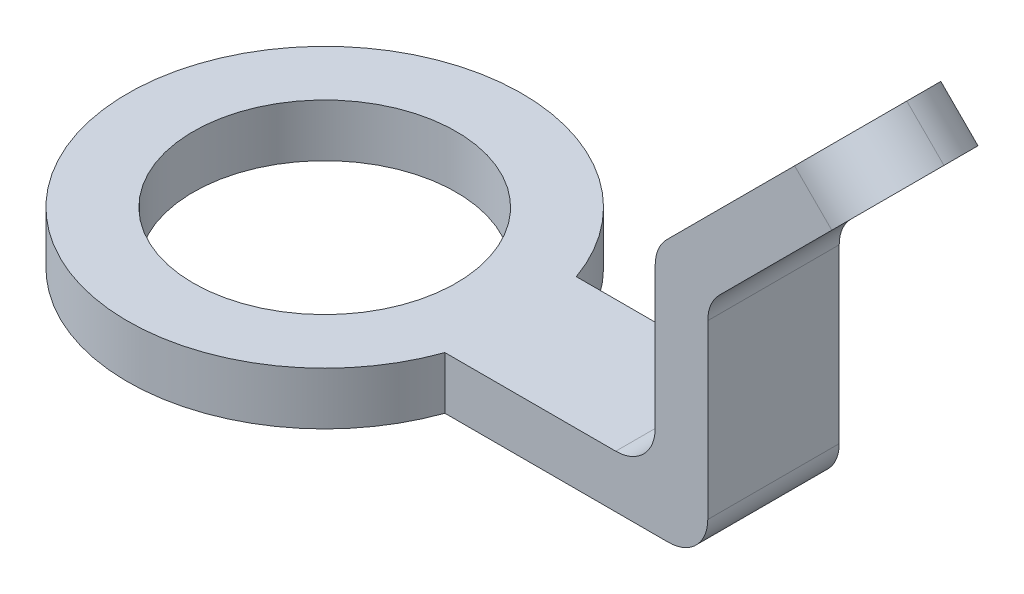
ISO-10303-21;
HEADER;
FILE_DESCRIPTION(('STEP AP214'),'2;1');
FILE_NAME('part.step','',(''),(''),'','','');
FILE_SCHEMA(('AUTOMOTIVE_DESIGN { 1 0 10303 214 1 1 1 1 }'));
ENDSEC;
DATA;
#1=APPLICATION_CONTEXT('core data for automotive mechanical design processes');
#2=APPLICATION_PROTOCOL_DEFINITION('international standard','automotive_design',2000,#1);
#3=PRODUCT_CONTEXT('',#1,'mechanical');
#4=PRODUCT('Part','Part','',(#3));
#5=PRODUCT_RELATED_PRODUCT_CATEGORY('part','',(#4));
#6=PRODUCT_DEFINITION_FORMATION('','',#4);
#7=PRODUCT_DEFINITION_CONTEXT('part definition',#1,'design');
#8=PRODUCT_DEFINITION('design','',#6,#7);
#9=PRODUCT_DEFINITION_SHAPE('','',#8);
#10=(LENGTH_UNIT() NAMED_UNIT(*) SI_UNIT(.MILLI.,.METRE.));
#11=(NAMED_UNIT(*) PLANE_ANGLE_UNIT() SI_UNIT($,.RADIAN.));
#12=(NAMED_UNIT(*) SI_UNIT($,.STERADIAN.) SOLID_ANGLE_UNIT());
#13=UNCERTAINTY_MEASURE_WITH_UNIT(LENGTH_MEASURE(1.E-05),#10,'distance_accuracy_value','');
#14=(GEOMETRIC_REPRESENTATION_CONTEXT(3) GLOBAL_UNCERTAINTY_ASSIGNED_CONTEXT((#13)) GLOBAL_UNIT_ASSIGNED_CONTEXT((#10,
#11,#12)) REPRESENTATION_CONTEXT('',''));
#15=CARTESIAN_POINT('',(0.,0.,0.));
#16=DIRECTION('',(0.,0.,1.));
#17=DIRECTION('',(1.,0.,0.));
#18=AXIS2_PLACEMENT_3D('',#15,#16,#17);
#19=CARTESIAN_POINT('',(0.,4.,0.));
#20=DIRECTION('',(0.,1.,0.));
#21=DIRECTION('',(0.,0.,1.));
#22=AXIS2_PLACEMENT_3D('',#19,#20,#21);
#23=PLANE('',#22);
#24=DIRECTION('',(1.,0.,0.));
#25=VECTOR('',#24,1.);
#26=CARTESIAN_POINT('',(34.142135623731,4.,5.));
#27=LINE('',#26,#25);
#28=CARTESIAN_POINT('',(14.1421356237309,4.,5.));
#29=VERTEX_POINT('',#28);
#30=CARTESIAN_POINT('',(27.142135623731,4.,5.));
#31=VERTEX_POINT('',#30);
#32=EDGE_CURVE('E147',#29,#31,#27,.T.);
#33=ORIENTED_EDGE('',*,*,#32,.T.);
#34=DIRECTION('',(0.,0.,1.));
#35=VECTOR('',#34,1.);
#36=CARTESIAN_POINT('',(27.142135623731,4.,-5.));
#37=LINE('',#36,#35);
#38=CARTESIAN_POINT('',(27.142135623731,4.,-5.));
#39=VERTEX_POINT('',#38);
#40=EDGE_CURVE('E54',#31,#39,#37,.F.);
#41=ORIENTED_EDGE('',*,*,#40,.T.);
#42=DIRECTION('',(-1.,0.,0.));
#43=VECTOR('',#42,1.);
#44=CARTESIAN_POINT('',(34.142135623731,4.,-5.));
#45=LINE('',#44,#43);
#46=CARTESIAN_POINT('',(14.142135623731,4.,-4.99999999999999));
#47=VERTEX_POINT('',#46);
#48=EDGE_CURVE('E131',#39,#47,#45,.T.);
#49=ORIENTED_EDGE('',*,*,#48,.T.);
#50=CARTESIAN_POINT('',(0.,4.,0.));
#51=DIRECTION('',(0.,1.,0.));
#52=DIRECTION('',(0.,0.,1.));
#53=AXIS2_PLACEMENT_3D('',#50,#51,#52);
#54=CIRCLE('',#53,15.);
#55=EDGE_CURVE('E134',#47,#29,#54,.T.);
#56=ORIENTED_EDGE('',*,*,#55,.T.);
#57=EDGE_LOOP('',(#33,#41,#49,#56));
#58=FACE_BOUND('',#57,.T.);
#59=CARTESIAN_POINT('',(0.,4.,0.));
#60=DIRECTION('',(0.,1.,0.));
#61=DIRECTION('',(0.,0.,1.));
#62=AXIS2_PLACEMENT_3D('',#59,#60,#61);
#63=CIRCLE('',#62,10.);
#64=CARTESIAN_POINT('',(0.,4.,10.));
#65=VERTEX_POINT('',#64);
#66=EDGE_CURVE('E229',#65,#65,#63,.T.);
#67=ORIENTED_EDGE('',*,*,#66,.F.);
#68=EDGE_LOOP('',(#67));
#69=FACE_BOUND('',#68,.T.);
#70=ADVANCED_FACE('F39',(#58,#69),#23,.T.);
#71=CARTESIAN_POINT('',(0.,0.,0.));
#72=DIRECTION('',(0.,1.,0.));
#73=DIRECTION('',(0.,0.,1.));
#74=AXIS2_PLACEMENT_3D('',#71,#72,#73);
#75=PLANE('',#74);
#76=DIRECTION('',(-1.,0.,0.));
#77=VECTOR('',#76,1.);
#78=CARTESIAN_POINT('',(34.142135623731,0.,-5.));
#79=LINE('',#78,#77);
#80=CARTESIAN_POINT('',(31.142135623731,0.,-5.));
#81=VERTEX_POINT('',#80);
#82=CARTESIAN_POINT('',(14.142135623731,0.,-4.99999999999999));
#83=VERTEX_POINT('',#82);
#84=EDGE_CURVE('E151',#81,#83,#79,.T.);
#85=ORIENTED_EDGE('',*,*,#84,.F.);
#86=DIRECTION('',(0.,0.,-1.));
#87=VECTOR('',#86,1.);
#88=CARTESIAN_POINT('',(31.142135623731,0.,0.));
#89=LINE('',#88,#87);
#90=CARTESIAN_POINT('',(31.142135623731,0.,5.));
#91=VERTEX_POINT('',#90);
#92=EDGE_CURVE('E203',#81,#91,#89,.F.);
#93=ORIENTED_EDGE('',*,*,#92,.T.);
#94=DIRECTION('',(1.,0.,0.));
#95=VECTOR('',#94,1.);
#96=CARTESIAN_POINT('',(34.142135623731,0.,5.));
#97=LINE('',#96,#95);
#98=CARTESIAN_POINT('',(14.1421356237309,0.,5.));
#99=VERTEX_POINT('',#98);
#100=EDGE_CURVE('E138',#99,#91,#97,.T.);
#101=ORIENTED_EDGE('',*,*,#100,.F.);
#102=CARTESIAN_POINT('',(0.,0.,0.));
#103=DIRECTION('',(0.,1.,0.));
#104=DIRECTION('',(0.,0.,1.));
#105=AXIS2_PLACEMENT_3D('',#102,#103,#104);
#106=CIRCLE('',#105,15.);
#107=EDGE_CURVE('E243',#83,#99,#106,.T.);
#108=ORIENTED_EDGE('',*,*,#107,.F.);
#109=EDGE_LOOP('',(#85,#93,#101,#108));
#110=FACE_BOUND('',#109,.T.);
#111=CARTESIAN_POINT('',(0.,0.,0.));
#112=DIRECTION('',(0.,1.,0.));
#113=DIRECTION('',(0.,0.,1.));
#114=AXIS2_PLACEMENT_3D('',#111,#112,#113);
#115=CIRCLE('',#114,10.);
#116=CARTESIAN_POINT('',(0.,0.,10.));
#117=VERTEX_POINT('',#116);
#118=EDGE_CURVE('E225',#117,#117,#115,.T.);
#119=ORIENTED_EDGE('',*,*,#118,.T.);
#120=EDGE_LOOP('',(#119));
#121=FACE_BOUND('',#120,.T.);
#122=ADVANCED_FACE('F260',(#110,#121),#75,.F.);
#123=CARTESIAN_POINT('',(34.142135623731,4.,-5.));
#124=DIRECTION('',(0.,0.,1.));
#125=DIRECTION('',(1.,0.,0.));
#126=AXIS2_PLACEMENT_3D('',#123,#124,#125);
#127=PLANE('',#126);
#128=DIRECTION('',(0.,-1.,0.));
#129=VECTOR('',#128,1.);
#130=CARTESIAN_POINT('',(30.142135623731,19.,-4.99999999999999));
#131=LINE('',#130,#129);
#132=CARTESIAN_POINT('',(30.142135623731,17.7573593128807,-4.99999999999999));
#133=VERTEX_POINT('',#132);
#134=CARTESIAN_POINT('',(30.142135623731,7.,-4.99999999999999));
#135=VERTEX_POINT('',#134);
#136=EDGE_CURVE('E220',#133,#135,#131,.T.);
#137=ORIENTED_EDGE('',*,*,#136,.F.);
#138=CARTESIAN_POINT('',(33.142135623731,17.7573593128807,-5.));
#139=DIRECTION('',(0.,0.,1.));
#140=DIRECTION('',(1.,0.,0.));
#141=AXIS2_PLACEMENT_3D('',#138,#139,#140);
#142=CIRCLE('',#141,3.);
#143=CARTESIAN_POINT('',(31.0208152801713,19.8786796564404,-4.99999999999999));
#144=VERTEX_POINT('',#143);
#145=EDGE_CURVE('E201',#133,#144,#142,.F.);
#146=ORIENTED_EDGE('',*,*,#145,.T.);
#147=DIRECTION('',(-0.707106781186548,-0.707106781186547,0.));
#148=VECTOR('',#147,1.);
#149=CARTESIAN_POINT('',(44.2842712474619,33.1421356237309,-4.99999999999999));
#150=LINE('',#149,#148);
#151=CARTESIAN_POINT('',(40.7487373415292,29.6066017177982,-4.99999999999999));
#152=VERTEX_POINT('',#151);
#153=EDGE_CURVE('E226',#152,#144,#150,.T.);
#154=ORIENTED_EDGE('',*,*,#153,.F.);
#155=DIRECTION('',(-0.707106781186548,0.707106781186547,0.));
#156=VECTOR('',#155,1.);
#157=CARTESIAN_POINT('',(43.5771644662754,26.778174593052,-5.));
#158=LINE('',#157,#156);
#159=CARTESIAN_POINT('',(43.5771644662754,26.778174593052,-4.99999999999999));
#160=VERTEX_POINT('',#159);
#161=EDGE_CURVE('E162',#152,#160,#158,.F.);
#162=ORIENTED_EDGE('',*,*,#161,.T.);
#163=DIRECTION('',(0.707106781186549,0.707106781186546,0.));
#164=VECTOR('',#163,1.);
#165=CARTESIAN_POINT('',(34.142135623731,17.3431457505076,-4.99999999999999));
#166=LINE('',#165,#164);
#167=CARTESIAN_POINT('',(35.0208152801713,18.221825406948,-4.99999999999999));
#168=VERTEX_POINT('',#167);
#169=EDGE_CURVE('E232',#168,#160,#166,.T.);
#170=ORIENTED_EDGE('',*,*,#169,.F.);
#171=CARTESIAN_POINT('',(37.142135623731,16.1005050633883,-5.));
#172=DIRECTION('',(0.,0.,1.));
#173=DIRECTION('',(1.,0.,0.));
#174=AXIS2_PLACEMENT_3D('',#171,#172,#173);
#175=CIRCLE('',#174,3.);
#176=CARTESIAN_POINT('',(34.142135623731,16.1005050633883,-5.));
#177=VERTEX_POINT('',#176);
#178=EDGE_CURVE('E208',#168,#177,#175,.T.);
#179=ORIENTED_EDGE('',*,*,#178,.T.);
#180=DIRECTION('',(0.,-1.,0.));
#181=VECTOR('',#180,1.);
#182=CARTESIAN_POINT('',(34.142135623731,4.,-5.));
#183=LINE('',#182,#181);
#184=CARTESIAN_POINT('',(34.142135623731,3.,-5.));
#185=VERTEX_POINT('',#184);
#186=EDGE_CURVE('E217',#177,#185,#183,.T.);
#187=ORIENTED_EDGE('',*,*,#186,.T.);
#188=CARTESIAN_POINT('',(31.142135623731,3.,-5.));
#189=DIRECTION('',(0.,0.,1.));
#190=DIRECTION('',(1.,0.,0.));
#191=AXIS2_PLACEMENT_3D('',#188,#189,#190);
#192=CIRCLE('',#191,3.);
#193=EDGE_CURVE('E62',#185,#81,#192,.F.);
#194=ORIENTED_EDGE('',*,*,#193,.T.);
#195=ORIENTED_EDGE('',*,*,#84,.T.);
#196=DIRECTION('',(0.,-1.,0.));
#197=VECTOR('',#196,1.);
#198=CARTESIAN_POINT('',(14.142135623731,4.,-4.99999999999999));
#199=LINE('',#198,#197);
#200=EDGE_CURVE('E143',#47,#83,#199,.T.);
#201=ORIENTED_EDGE('',*,*,#200,.F.);
#202=ORIENTED_EDGE('',*,*,#48,.F.);
#203=CARTESIAN_POINT('',(27.142135623731,7.,-5.));
#204=DIRECTION('',(0.,0.,1.));
#205=DIRECTION('',(1.,0.,0.));
#206=AXIS2_PLACEMENT_3D('',#203,#204,#205);
#207=CIRCLE('',#206,3.);
#208=EDGE_CURVE('E11',#39,#135,#207,.T.);
#209=ORIENTED_EDGE('',*,*,#208,.T.);
#210=EDGE_LOOP('',(#137,#146,#154,#162,#170,#179,#187,#194,#195,#201,#202,#209));
#211=FACE_BOUND('',#210,.T.);
#212=ADVANCED_FACE('F150',(#211),#127,.F.);
#213=CARTESIAN_POINT('',(0.,4.,0.));
#214=DIRECTION('',(0.,-1.,0.));
#215=DIRECTION('',(0.,0.,-1.));
#216=AXIS2_PLACEMENT_3D('',#213,#214,#215);
#217=CYLINDRICAL_SURFACE('',#216,15.);
#218=ORIENTED_EDGE('',*,*,#107,.T.);
#219=DIRECTION('',(0.,-1.,0.));
#220=VECTOR('',#219,1.);
#221=CARTESIAN_POINT('',(14.1421356237309,4.,5.));
#222=LINE('',#221,#220);
#223=EDGE_CURVE('E145',#29,#99,#222,.T.);
#224=ORIENTED_EDGE('',*,*,#223,.F.);
#225=ORIENTED_EDGE('',*,*,#55,.F.);
#226=ORIENTED_EDGE('',*,*,#200,.T.);
#227=EDGE_LOOP('',(#218,#224,#225,#226));
#228=FACE_BOUND('',#227,.T.);
#229=ADVANCED_FACE('F142',(#228),#217,.T.);
#230=CARTESIAN_POINT('',(34.142135623731,4.,5.));
#231=DIRECTION('',(0.,0.,-1.));
#232=DIRECTION('',(-1.,0.,0.));
#233=AXIS2_PLACEMENT_3D('',#230,#231,#232);
#234=PLANE('',#233);
#235=DIRECTION('',(-0.707106781186548,-0.707106781186547,0.));
#236=VECTOR('',#235,1.);
#237=CARTESIAN_POINT('',(44.2842712474619,33.1421356237309,5.00000000000001));
#238=LINE('',#237,#236);
#239=CARTESIAN_POINT('',(40.7487373415292,29.6066017177982,5.00000000000001));
#240=VERTEX_POINT('',#239);
#241=CARTESIAN_POINT('',(31.0208152801713,19.8786796564404,5.00000000000001));
#242=VERTEX_POINT('',#241);
#243=EDGE_CURVE('E237',#240,#242,#238,.T.);
#244=ORIENTED_EDGE('',*,*,#243,.T.);
#245=CARTESIAN_POINT('',(33.142135623731,17.7573593128807,5.));
#246=DIRECTION('',(0.,0.,-1.));
#247=DIRECTION('',(-1.,0.,0.));
#248=AXIS2_PLACEMENT_3D('',#245,#246,#247);
#249=CIRCLE('',#248,3.);
#250=CARTESIAN_POINT('',(30.142135623731,17.7573593128807,5.00000000000001));
#251=VERTEX_POINT('',#250);
#252=EDGE_CURVE('E193',#242,#251,#249,.F.);
#253=ORIENTED_EDGE('',*,*,#252,.T.);
#254=DIRECTION('',(0.,-1.,0.));
#255=VECTOR('',#254,1.);
#256=CARTESIAN_POINT('',(30.142135623731,19.,5.00000000000001));
#257=LINE('',#256,#255);
#258=CARTESIAN_POINT('',(30.142135623731,7.,5.00000000000001));
#259=VERTEX_POINT('',#258);
#260=EDGE_CURVE('E214',#251,#259,#257,.T.);
#261=ORIENTED_EDGE('',*,*,#260,.T.);
#262=CARTESIAN_POINT('',(27.142135623731,7.,5.));
#263=DIRECTION('',(0.,0.,-1.));
#264=DIRECTION('',(-1.,0.,0.));
#265=AXIS2_PLACEMENT_3D('',#262,#263,#264);
#266=CIRCLE('',#265,3.);
#267=EDGE_CURVE('E47',#259,#31,#266,.T.);
#268=ORIENTED_EDGE('',*,*,#267,.T.);
#269=ORIENTED_EDGE('',*,*,#32,.F.);
#270=ORIENTED_EDGE('',*,*,#223,.T.);
#271=ORIENTED_EDGE('',*,*,#100,.T.);
#272=CARTESIAN_POINT('',(31.142135623731,3.,5.));
#273=DIRECTION('',(0.,0.,-1.));
#274=DIRECTION('',(-1.,0.,0.));
#275=AXIS2_PLACEMENT_3D('',#272,#273,#274);
#276=CIRCLE('',#275,3.);
#277=CARTESIAN_POINT('',(34.142135623731,3.,5.));
#278=VERTEX_POINT('',#277);
#279=EDGE_CURVE('E191',#91,#278,#276,.F.);
#280=ORIENTED_EDGE('',*,*,#279,.T.);
#281=DIRECTION('',(0.,-1.,0.));
#282=VECTOR('',#281,1.);
#283=CARTESIAN_POINT('',(34.142135623731,4.,5.));
#284=LINE('',#283,#282);
#285=CARTESIAN_POINT('',(34.142135623731,16.1005050633883,5.));
#286=VERTEX_POINT('',#285);
#287=EDGE_CURVE('E157',#286,#278,#284,.T.);
#288=ORIENTED_EDGE('',*,*,#287,.F.);
#289=CARTESIAN_POINT('',(37.142135623731,16.1005050633883,5.));
#290=DIRECTION('',(0.,0.,-1.));
#291=DIRECTION('',(-1.,0.,0.));
#292=AXIS2_PLACEMENT_3D('',#289,#290,#291);
#293=CIRCLE('',#292,3.);
#294=CARTESIAN_POINT('',(35.0208152801713,18.221825406948,5.00000000000001));
#295=VERTEX_POINT('',#294);
#296=EDGE_CURVE('E206',#286,#295,#293,.T.);
#297=ORIENTED_EDGE('',*,*,#296,.T.);
#298=DIRECTION('',(0.707106781186549,0.707106781186546,0.));
#299=VECTOR('',#298,1.);
#300=CARTESIAN_POINT('',(34.142135623731,17.3431457505076,5.00000000000001));
#301=LINE('',#300,#299);
#302=CARTESIAN_POINT('',(43.5771644662754,26.778174593052,5.00000000000001));
#303=VERTEX_POINT('',#302);
#304=EDGE_CURVE('E176',#295,#303,#301,.T.);
#305=ORIENTED_EDGE('',*,*,#304,.T.);
#306=DIRECTION('',(-0.707106781186548,0.707106781186547,0.));
#307=VECTOR('',#306,1.);
#308=CARTESIAN_POINT('',(40.7487373415292,29.6066017177982,5.));
#309=LINE('',#308,#307);
#310=EDGE_CURVE('E170',#303,#240,#309,.T.);
#311=ORIENTED_EDGE('',*,*,#310,.T.);
#312=EDGE_LOOP('',(#244,#253,#261,#268,#269,#270,#271,#280,#288,#297,#305,#311));
#313=FACE_BOUND('',#312,.T.);
#314=ADVANCED_FACE('F212',(#313),#234,.F.);
#315=CARTESIAN_POINT('',(34.142135623731,4.,-5.));
#316=DIRECTION('',(-1.,0.,0.));
#317=DIRECTION('',(0.,0.,1.));
#318=AXIS2_PLACEMENT_3D('',#315,#316,#317);
#319=PLANE('',#318);
#320=ORIENTED_EDGE('',*,*,#186,.F.);
#321=DIRECTION('',(0.,0.,1.));
#322=VECTOR('',#321,1.);
#323=CARTESIAN_POINT('',(34.142135623731,16.1005050633883,-5.));
#324=LINE('',#323,#322);
#325=EDGE_CURVE('E183',#177,#286,#324,.T.);
#326=ORIENTED_EDGE('',*,*,#325,.T.);
#327=ORIENTED_EDGE('',*,*,#287,.T.);
#328=DIRECTION('',(0.,0.,-1.));
#329=VECTOR('',#328,1.);
#330=CARTESIAN_POINT('',(34.142135623731,3.,-5.));
#331=LINE('',#330,#329);
#332=EDGE_CURVE('E172',#278,#185,#331,.T.);
#333=ORIENTED_EDGE('',*,*,#332,.T.);
#334=EDGE_LOOP('',(#320,#326,#327,#333));
#335=FACE_BOUND('',#334,.T.);
#336=ADVANCED_FACE('F252',(#335),#319,.F.);
#337=CARTESIAN_POINT('',(0.,4.,0.));
#338=DIRECTION('',(0.,-1.,0.));
#339=DIRECTION('',(0.,0.,-1.));
#340=AXIS2_PLACEMENT_3D('',#337,#338,#339);
#341=CYLINDRICAL_SURFACE('',#340,10.);
#342=ORIENTED_EDGE('',*,*,#66,.T.);
#343=EDGE_LOOP('',(#342));
#344=FACE_BOUND('',#343,.T.);
#345=ORIENTED_EDGE('',*,*,#118,.F.);
#346=EDGE_LOOP('',(#345));
#347=FACE_BOUND('',#346,.T.);
#348=ADVANCED_FACE('F266',(#344,#347),#341,.F.);
#349=CARTESIAN_POINT('',(30.142135623731,19.,-4.99999999999999));
#350=DIRECTION('',(-1.,0.,0.));
#351=DIRECTION('',(0.,0.,1.));
#352=AXIS2_PLACEMENT_3D('',#349,#350,#351);
#353=PLANE('',#352);
#354=ORIENTED_EDGE('',*,*,#260,.F.);
#355=DIRECTION('',(0.,0.,1.));
#356=VECTOR('',#355,1.);
#357=CARTESIAN_POINT('',(30.142135623731,17.7573593128807,-4.99999999999999));
#358=LINE('',#357,#356);
#359=EDGE_CURVE('E198',#251,#133,#358,.F.);
#360=ORIENTED_EDGE('',*,*,#359,.T.);
#361=ORIENTED_EDGE('',*,*,#136,.T.);
#362=DIRECTION('',(0.,0.,1.));
#363=VECTOR('',#362,1.);
#364=CARTESIAN_POINT('',(30.142135623731,7.,5.00000000000001));
#365=LINE('',#364,#363);
#366=EDGE_CURVE('E195',#135,#259,#365,.T.);
#367=ORIENTED_EDGE('',*,*,#366,.T.);
#368=EDGE_LOOP('',(#354,#360,#361,#367));
#369=FACE_BOUND('',#368,.T.);
#370=ADVANCED_FACE('F223',(#369),#353,.T.);
#371=CARTESIAN_POINT('',(44.2842712474619,33.1421356237309,-4.99999999999999));
#372=DIRECTION('',(-0.707106781186547,0.707106781186548,0.));
#373=DIRECTION('',(-0.707106781186548,-0.707106781186547,0.));
#374=AXIS2_PLACEMENT_3D('',#371,#372,#373);
#375=PLANE('',#374);
#376=CARTESIAN_POINT('',(40.7487373415292,29.6066017177982,0.));
#377=DIRECTION('',(-0.707106781186546,0.707106781186549,0.));
#378=DIRECTION('',(-0.707106781186549,-0.707106781186546,0.));
#379=AXIS2_PLACEMENT_3D('',#376,#377,#378);
#380=CIRCLE('',#379,1.8);
#381=CARTESIAN_POINT('',(39.4759451353934,28.3338095116624,0.));
#382=VERTEX_POINT('',#381);
#383=EDGE_CURVE('E180',#382,#382,#380,.T.);
#384=ORIENTED_EDGE('',*,*,#383,.F.);
#385=EDGE_LOOP('',(#384));
#386=FACE_BOUND('',#385,.T.);
#387=ORIENTED_EDGE('',*,*,#153,.T.);
#388=DIRECTION('',(0.,0.,1.));
#389=VECTOR('',#388,1.);
#390=CARTESIAN_POINT('',(31.0208152801713,19.8786796564404,-4.99999999999999));
#391=LINE('',#390,#389);
#392=EDGE_CURVE('E188',#144,#242,#391,.T.);
#393=ORIENTED_EDGE('',*,*,#392,.T.);
#394=ORIENTED_EDGE('',*,*,#243,.F.);
#395=CARTESIAN_POINT('',(40.7487373415292,29.6066017177982,0.));
#396=DIRECTION('',(-0.707106781186547,0.707106781186548,0.));
#397=DIRECTION('',(-0.707106781186548,-0.707106781186547,0.));
#398=AXIS2_PLACEMENT_3D('',#395,#396,#397);
#399=CIRCLE('',#398,5.);
#400=CARTESIAN_POINT('',(44.2842712474619,33.1421356237309,0.));
#401=VERTEX_POINT('',#400);
#402=EDGE_CURVE('E153',#240,#401,#399,.T.);
#403=ORIENTED_EDGE('',*,*,#402,.T.);
#404=CARTESIAN_POINT('',(40.7487373415292,29.6066017177982,0.));
#405=DIRECTION('',(-0.707106781186547,0.707106781186548,0.));
#406=DIRECTION('',(-0.707106781186548,-0.707106781186547,0.));
#407=AXIS2_PLACEMENT_3D('',#404,#405,#406);
#408=CIRCLE('',#407,5.);
#409=EDGE_CURVE('E155',#401,#152,#408,.T.);
#410=ORIENTED_EDGE('',*,*,#409,.T.);
#411=EDGE_LOOP('',(#387,#393,#394,#403,#410));
#412=FACE_BOUND('',#411,.T.);
#413=ADVANCED_FACE('F275',(#386,#412),#375,.T.);
#414=CARTESIAN_POINT('',(34.142135623731,17.3431457505076,-4.99999999999999));
#415=DIRECTION('',(0.707106781186546,-0.707106781186549,0.));
#416=DIRECTION('',(0.707106781186549,0.707106781186546,0.));
#417=AXIS2_PLACEMENT_3D('',#414,#415,#416);
#418=PLANE('',#417);
#419=CARTESIAN_POINT('',(43.5771644662754,26.778174593052,0.));
#420=DIRECTION('',(0.707106781186546,-0.707106781186549,0.));
#421=DIRECTION('',(0.707106781186549,0.707106781186546,0.));
#422=AXIS2_PLACEMENT_3D('',#419,#420,#421);
#423=CIRCLE('',#422,1.8);
#424=CARTESIAN_POINT('',(44.8499566724112,28.0509667991878,0.));
#425=VERTEX_POINT('',#424);
#426=EDGE_CURVE('E177',#425,#425,#423,.T.);
#427=ORIENTED_EDGE('',*,*,#426,.F.);
#428=EDGE_LOOP('',(#427));
#429=FACE_BOUND('',#428,.T.);
#430=ORIENTED_EDGE('',*,*,#304,.F.);
#431=DIRECTION('',(0.,0.,1.));
#432=VECTOR('',#431,1.);
#433=CARTESIAN_POINT('',(35.0208152801713,18.221825406948,-4.99999999999999));
#434=LINE('',#433,#432);
#435=EDGE_CURVE('E186',#295,#168,#434,.F.);
#436=ORIENTED_EDGE('',*,*,#435,.T.);
#437=ORIENTED_EDGE('',*,*,#169,.T.);
#438=CARTESIAN_POINT('',(43.5771644662754,26.778174593052,0.));
#439=DIRECTION('',(0.707106781186546,-0.707106781186549,0.));
#440=DIRECTION('',(0.707106781186549,0.707106781186546,0.));
#441=AXIS2_PLACEMENT_3D('',#438,#439,#440);
#442=CIRCLE('',#441,5.);
#443=CARTESIAN_POINT('',(47.1126983722081,30.3137084989847,0.));
#444=VERTEX_POINT('',#443);
#445=EDGE_CURVE('E168',#160,#444,#442,.T.);
#446=ORIENTED_EDGE('',*,*,#445,.T.);
#447=CARTESIAN_POINT('',(43.5771644662754,26.778174593052,0.));
#448=DIRECTION('',(0.707106781186546,-0.707106781186549,0.));
#449=DIRECTION('',(0.707106781186549,0.707106781186546,0.));
#450=AXIS2_PLACEMENT_3D('',#447,#448,#449);
#451=CIRCLE('',#450,5.);
#452=EDGE_CURVE('E165',#444,#303,#451,.T.);
#453=ORIENTED_EDGE('',*,*,#452,.T.);
#454=EDGE_LOOP('',(#430,#436,#437,#446,#453));
#455=FACE_BOUND('',#454,.T.);
#456=ADVANCED_FACE('F298',(#429,#455),#418,.T.);
#457=CARTESIAN_POINT('',(50.2487373415292,20.1066017177982,0.));
#458=DIRECTION('',(0.707106781186548,-0.707106781186547,0.));
#459=DIRECTION('',(0.707106781186547,0.707106781186548,0.));
#460=AXIS2_PLACEMENT_3D('',#457,#458,#459);
#461=CYLINDRICAL_SURFACE('',#460,5.);
#462=ORIENTED_EDGE('',*,*,#310,.F.);
#463=ORIENTED_EDGE('',*,*,#452,.F.);
#464=DIRECTION('',(-0.707106781186548,0.707106781186547,0.));
#465=VECTOR('',#464,1.);
#466=CARTESIAN_POINT('',(47.1126983722081,30.3137084989847,0.));
#467=LINE('',#466,#465);
#468=EDGE_CURVE('E173',#401,#444,#467,.F.);
#469=ORIENTED_EDGE('',*,*,#468,.F.);
#470=ORIENTED_EDGE('',*,*,#402,.F.);
#471=EDGE_LOOP('',(#462,#463,#469,#470));
#472=FACE_BOUND('',#471,.T.);
#473=ADVANCED_FACE('F295',(#472),#461,.T.);
#474=CARTESIAN_POINT('',(43.5771644662754,26.778174593052,0.));
#475=DIRECTION('',(0.707106781186548,-0.707106781186547,0.));
#476=DIRECTION('',(0.707106781186547,0.707106781186548,0.));
#477=AXIS2_PLACEMENT_3D('',#474,#475,#476);
#478=CYLINDRICAL_SURFACE('',#477,5.);
#479=ORIENTED_EDGE('',*,*,#445,.F.);
#480=ORIENTED_EDGE('',*,*,#161,.F.);
#481=ORIENTED_EDGE('',*,*,#409,.F.);
#482=ORIENTED_EDGE('',*,*,#468,.T.);
#483=EDGE_LOOP('',(#479,#480,#481,#482));
#484=FACE_BOUND('',#483,.T.);
#485=ADVANCED_FACE('F291',(#484),#478,.T.);
#486=CARTESIAN_POINT('',(40.7487373415292,29.6066017177982,0.));
#487=DIRECTION('',(-0.707106781186546,0.707106781186549,0.));
#488=DIRECTION('',(-0.707106781186549,-0.707106781186546,0.));
#489=AXIS2_PLACEMENT_3D('',#486,#487,#488);
#490=CYLINDRICAL_SURFACE('',#489,1.8);
#491=ORIENTED_EDGE('',*,*,#426,.T.);
#492=EDGE_LOOP('',(#491));
#493=FACE_BOUND('',#492,.T.);
#494=ORIENTED_EDGE('',*,*,#383,.T.);
#495=EDGE_LOOP('',(#494));
#496=FACE_BOUND('',#495,.T.);
#497=ADVANCED_FACE('F294',(#493,#496),#490,.F.);
#498=CARTESIAN_POINT('',(37.142135623731,16.1005050633883,-5.));
#499=DIRECTION('',(0.,0.,1.));
#500=DIRECTION('',(1.,0.,0.));
#501=AXIS2_PLACEMENT_3D('',#498,#499,#500);
#502=CYLINDRICAL_SURFACE('',#501,3.);
#503=ORIENTED_EDGE('',*,*,#178,.F.);
#504=ORIENTED_EDGE('',*,*,#435,.F.);
#505=ORIENTED_EDGE('',*,*,#296,.F.);
#506=ORIENTED_EDGE('',*,*,#325,.F.);
#507=EDGE_LOOP('',(#503,#504,#505,#506));
#508=FACE_BOUND('',#507,.T.);
#509=ADVANCED_FACE('F300',(#508),#502,.F.);
#510=CARTESIAN_POINT('',(33.142135623731,17.7573593128807,-4.99999999999999));
#511=DIRECTION('',(0.,0.,1.));
#512=DIRECTION('',(1.,0.,0.));
#513=AXIS2_PLACEMENT_3D('',#510,#511,#512);
#514=CYLINDRICAL_SURFACE('',#513,3.);
#515=ORIENTED_EDGE('',*,*,#145,.F.);
#516=ORIENTED_EDGE('',*,*,#359,.F.);
#517=ORIENTED_EDGE('',*,*,#252,.F.);
#518=ORIENTED_EDGE('',*,*,#392,.F.);
#519=EDGE_LOOP('',(#515,#516,#517,#518));
#520=FACE_BOUND('',#519,.T.);
#521=ADVANCED_FACE('F303',(#520),#514,.T.);
#522=CARTESIAN_POINT('',(31.142135623731,3.,-5.));
#523=DIRECTION('',(0.,0.,-1.));
#524=DIRECTION('',(-1.,0.,0.));
#525=AXIS2_PLACEMENT_3D('',#522,#523,#524);
#526=CYLINDRICAL_SURFACE('',#525,3.);
#527=ORIENTED_EDGE('',*,*,#279,.F.);
#528=ORIENTED_EDGE('',*,*,#92,.F.);
#529=ORIENTED_EDGE('',*,*,#193,.F.);
#530=ORIENTED_EDGE('',*,*,#332,.F.);
#531=EDGE_LOOP('',(#527,#528,#529,#530));
#532=FACE_BOUND('',#531,.T.);
#533=ADVANCED_FACE('F256',(#532),#526,.T.);
#534=CARTESIAN_POINT('',(27.142135623731,7.,-4.99999999999999));
#535=DIRECTION('',(0.,0.,-1.));
#536=DIRECTION('',(-1.,0.,0.));
#537=AXIS2_PLACEMENT_3D('',#534,#535,#536);
#538=CYLINDRICAL_SURFACE('',#537,3.);
#539=ORIENTED_EDGE('',*,*,#208,.F.);
#540=ORIENTED_EDGE('',*,*,#40,.F.);
#541=ORIENTED_EDGE('',*,*,#267,.F.);
#542=ORIENTED_EDGE('',*,*,#366,.F.);
#543=EDGE_LOOP('',(#539,#540,#541,#542));
#544=FACE_BOUND('',#543,.T.);
#545=ADVANCED_FACE('F41',(#544),#538,.F.);
#546=CLOSED_SHELL('',(#70,#122,#212,#229,#314,#336,#348,#370,#413,#456,#473,#485,#497,#509,#521,
#533,#545));
#547=MANIFOLD_SOLID_BREP('B2',#546);
#548=ADVANCED_BREP_SHAPE_REPRESENTATION('',(#18,#547),#14);
#549=SHAPE_DEFINITION_REPRESENTATION(#9,#548);
ENDSEC;
END-ISO-10303-21;
